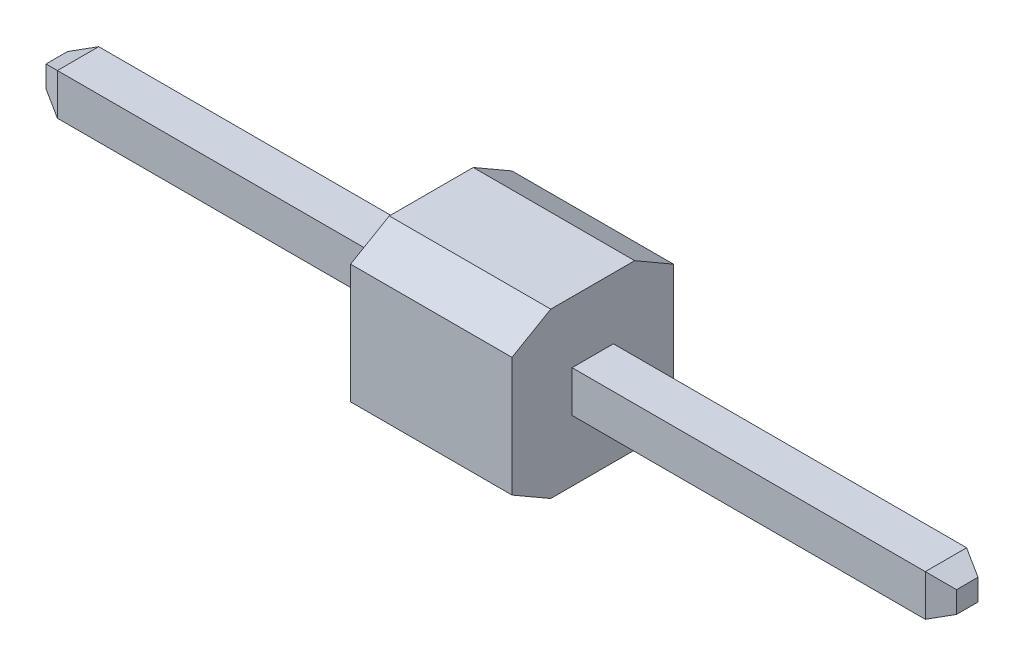
ISO-10303-21;
HEADER;
FILE_DESCRIPTION(('STEP AP214'),'2;1');
FILE_NAME('part.step','',(''),(''),'','','');
FILE_SCHEMA(('AUTOMOTIVE_DESIGN { 1 0 10303 214 1 1 1 1 }'));
ENDSEC;
DATA;
#1=APPLICATION_CONTEXT('core data for automotive mechanical design processes');
#2=APPLICATION_PROTOCOL_DEFINITION('international standard','automotive_design',2000,#1);
#3=PRODUCT_CONTEXT('',#1,'mechanical');
#4=PRODUCT('Part','Part','',(#3));
#5=PRODUCT_RELATED_PRODUCT_CATEGORY('part','',(#4));
#6=PRODUCT_DEFINITION_FORMATION('','',#4);
#7=PRODUCT_DEFINITION_CONTEXT('part definition',#1,'design');
#8=PRODUCT_DEFINITION('design','',#6,#7);
#9=PRODUCT_DEFINITION_SHAPE('','',#8);
#10=(LENGTH_UNIT() NAMED_UNIT(*) SI_UNIT(.MILLI.,.METRE.));
#11=(NAMED_UNIT(*) PLANE_ANGLE_UNIT() SI_UNIT($,.RADIAN.));
#12=(NAMED_UNIT(*) SI_UNIT($,.STERADIAN.) SOLID_ANGLE_UNIT());
#13=UNCERTAINTY_MEASURE_WITH_UNIT(LENGTH_MEASURE(1.E-05),#10,'distance_accuracy_value','');
#14=(GEOMETRIC_REPRESENTATION_CONTEXT(3) GLOBAL_UNCERTAINTY_ASSIGNED_CONTEXT((#13)) GLOBAL_UNIT_ASSIGNED_CONTEXT((#10,
#11,#12)) REPRESENTATION_CONTEXT('',''));
#15=CARTESIAN_POINT('',(0.,0.,0.));
#16=DIRECTION('',(0.,0.,1.));
#17=DIRECTION('',(1.,0.,0.));
#18=AXIS2_PLACEMENT_3D('',#15,#16,#17);
#19=CARTESIAN_POINT('',(5.42105035190831,-4.76287855189696,-2.62999781030106));
#20=DIRECTION('',(1.,-9.93476518829084E-08,4.37113882867379E-08));
#21=DIRECTION('',(-9.93476589883358E-08,-1.,8.74227765734759E-08));
#22=AXIS2_PLACEMENT_3D('',#19,#20,#21);
#23=PLANE('',#22);
#24=DIRECTION('',(-1.18186632778994E-08,-0.500000075710537,-0.866025360072935));
#25=VECTOR('',#24,1.);
#26=CARTESIAN_POINT('',(5.4210501597337,-6.00646825312919,-1.05999770158298));
#27=LINE('',#26,#25);
#28=CARTESIAN_POINT('',(5.4210501597337,-6.00646825312919,-1.05999770158298));
#29=VERTEX_POINT('',#28);
#30=CARTESIAN_POINT('',(5.42105015154549,-6.35287846709686,-1.65999767129884));
#31=VERTEX_POINT('',#30);
#32=EDGE_CURVE('E11',#29,#31,#27,.T.);
#33=ORIENTED_EDGE('',*,*,#32,.T.);
#34=DIRECTION('',(4.37113811813104E-08,-8.74227835422599E-08,-0.999999999999995));
#35=VECTOR('',#34,1.);
#36=CARTESIAN_POINT('',(5.42105015154549,-6.35287846709686,-1.65999767129884));
#37=LINE('',#36,#35);
#38=CARTESIAN_POINT('',(5.42105020837029,-6.35287858074648,-2.95999767129884));
#39=VERTEX_POINT('',#38);
#40=EDGE_CURVE('E304',#31,#39,#37,.T.);
#41=ORIENTED_EDGE('',*,*,#40,.T.);
#42=DIRECTION('',(8.75289963529268E-08,0.499999924289836,-0.866025447495713));
#43=VECTOR('',#42,1.);
#44=CARTESIAN_POINT('',(5.42105020837029,-6.35287858074648,-2.95999767129884));
#45=LINE('',#44,#43);
#46=CARTESIAN_POINT('',(5.42105026901216,-6.00646847168615,-3.55999770158298));
#47=VERTEX_POINT('',#46);
#48=EDGE_CURVE('E296',#39,#47,#45,.T.);
#49=ORIENTED_EDGE('',*,*,#48,.T.);
#50=DIRECTION('',(9.93476588435403E-08,0.999999999999991,-8.74227767225989E-08));
#51=VECTOR('',#50,1.);
#52=CARTESIAN_POINT('',(5.42105026901216,-6.00646847168615,-3.55999770158298));
#53=LINE('',#52,#51);
#54=CARTESIAN_POINT('',(5.42105045252513,-4.15928879471415,-3.55999786306856));
#55=VERTEX_POINT('',#54);
#56=EDGE_CURVE('E281',#47,#55,#53,.T.);
#57=ORIENTED_EDGE('',*,*,#56,.T.);
#58=DIRECTION('',(-1.18186632778994E-08,-0.500000075710538,-0.866025360072935));
#59=VECTOR('',#58,1.);
#60=CARTESIAN_POINT('',(5.42105046071334,-3.81287858074648,-2.95999789335269));
#61=LINE('',#60,#59);
#62=CARTESIAN_POINT('',(5.42105046071334,-3.81287858074648,-2.95999789335269));
#63=VERTEX_POINT('',#62);
#64=EDGE_CURVE('E265',#63,#55,#61,.T.);
#65=ORIENTED_EDGE('',*,*,#64,.F.);
#66=DIRECTION('',(4.37113811813104E-08,-8.74227828590458E-08,-0.999999999999995));
#67=VECTOR('',#66,1.);
#68=CARTESIAN_POINT('',(5.42105040388855,-3.81287846709686,-1.65999789335269));
#69=LINE('',#68,#67);
#70=CARTESIAN_POINT('',(5.42105040388855,-3.81287846709686,-1.65999789335269));
#71=VERTEX_POINT('',#70);
#72=EDGE_CURVE('E248',#71,#63,#69,.T.);
#73=ORIENTED_EDGE('',*,*,#72,.F.);
#74=DIRECTION('',(8.75289963529269E-08,0.499999924289835,-0.866025447495714));
#75=VECTOR('',#74,1.);
#76=CARTESIAN_POINT('',(5.42105034324668,-4.15928857615719,-1.05999786306856));
#77=LINE('',#76,#75);
#78=CARTESIAN_POINT('',(5.42105034324668,-4.15928857615719,-1.05999786306856));
#79=VERTEX_POINT('',#78);
#80=EDGE_CURVE('E242',#79,#71,#77,.T.);
#81=ORIENTED_EDGE('',*,*,#80,.F.);
#82=DIRECTION('',(9.93476588435403E-08,0.999999999999991,-8.74227763619768E-08));
#83=VECTOR('',#82,1.);
#84=CARTESIAN_POINT('',(5.4210501597337,-6.00646825312919,-1.05999770158298));
#85=LINE('',#84,#83);
#86=EDGE_CURVE('E236',#29,#79,#85,.T.);
#87=ORIENTED_EDGE('',*,*,#86,.F.);
#88=EDGE_LOOP('',(#33,#41,#49,#57,#65,#73,#81,#87));
#89=FACE_BOUND('',#88,.T.);
#90=DIRECTION('',(-4.37113817364219E-08,8.74227842895255E-08,0.999999999999995));
#91=VECTOR('',#90,1.);
#92=CARTESIAN_POINT('',(5.42105028832581,-5.40287855189696,-2.62999775435048));
#93=LINE('',#92,#91);
#94=CARTESIAN_POINT('',(5.42105028832581,-5.40287855189696,-2.62999775435048));
#95=VERTEX_POINT('',#94);
#96=CARTESIAN_POINT('',(5.42105026035053,-5.40287849594638,-1.98999775435048));
#97=VERTEX_POINT('',#96);
#98=EDGE_CURVE('E302',#95,#97,#93,.T.);
#99=ORIENTED_EDGE('',*,*,#98,.T.);
#100=DIRECTION('',(-9.93476592658907E-08,-0.999999999999991,8.74227763097972E-08));
#101=VECTOR('',#100,1.);
#102=CARTESIAN_POINT('',(5.42105032393303,-4.76287849594638,-1.98999781030106));
#103=LINE('',#102,#101);
#104=CARTESIAN_POINT('',(5.42105032393303,-4.76287849594638,-1.98999781030106));
#105=VERTEX_POINT('',#104);
#106=EDGE_CURVE('E293',#105,#97,#103,.T.);
#107=ORIENTED_EDGE('',*,*,#106,.F.);
#108=DIRECTION('',(-4.37113803486431E-08,8.74227842895254E-08,0.999999999999995));
#109=VECTOR('',#108,1.);
#110=CARTESIAN_POINT('',(5.42105035190831,-4.76287855189696,-2.62999781030106));
#111=LINE('',#110,#109);
#112=CARTESIAN_POINT('',(5.42105035190831,-4.76287855189696,-2.62999781030106));
#113=VERTEX_POINT('',#112);
#114=EDGE_CURVE('E278',#113,#105,#111,.T.);
#115=ORIENTED_EDGE('',*,*,#114,.F.);
#116=DIRECTION('',(-9.93476578781119E-08,-0.999999999999991,8.74227766567419E-08));
#117=VECTOR('',#116,1.);
#118=CARTESIAN_POINT('',(5.42105035190831,-4.76287855189696,-2.62999781030106));
#119=LINE('',#118,#117);
#120=EDGE_CURVE('E263',#113,#95,#119,.T.);
#121=ORIENTED_EDGE('',*,*,#120,.T.);
#122=EDGE_LOOP('',(#99,#107,#115,#121));
#123=FACE_BOUND('',#122,.T.);
#124=ADVANCED_FACE('F17',(#89,#123),#23,.T.);
#125=CARTESIAN_POINT('',(2.92105035190831,-4.76287830352783,-2.62999791957953));
#126=DIRECTION('',(1.,-9.93476518829084E-08,4.37113882867379E-08));
#127=DIRECTION('',(-9.93476589883358E-08,-1.,8.74227765734759E-08));
#128=AXIS2_PLACEMENT_3D('',#125,#126,#127);
#129=PLANE('',#128);
#130=DIRECTION('',(-1.18186626369119E-08,-0.500000075710537,-0.866025360072935));
#131=VECTOR('',#130,1.);
#132=CARTESIAN_POINT('',(2.9210501597337,-6.00646800476006,-1.05999781086145));
#133=LINE('',#132,#131);
#134=CARTESIAN_POINT('',(2.9210501597337,-6.00646800476006,-1.05999781086145));
#135=VERTEX_POINT('',#134);
#136=CARTESIAN_POINT('',(2.92105015154549,-6.35287821872773,-1.65999778057731));
#137=VERTEX_POINT('',#136);
#138=EDGE_CURVE('E24',#135,#137,#133,.T.);
#139=ORIENTED_EDGE('',*,*,#138,.F.);
#140=DIRECTION('',(9.9347659083955E-08,0.999999999999991,-8.74227763619768E-08));
#141=VECTOR('',#140,1.);
#142=CARTESIAN_POINT('',(2.9210501597337,-6.00646800476006,-1.05999781086145));
#143=LINE('',#142,#141);
#144=CARTESIAN_POINT('',(2.92105034324668,-4.15928832778806,-1.05999797234703));
#145=VERTEX_POINT('',#144);
#146=EDGE_CURVE('E300',#135,#145,#143,.T.);
#147=ORIENTED_EDGE('',*,*,#146,.T.);
#148=DIRECTION('',(8.75289957119393E-08,0.499999924289835,-0.866025447495714));
#149=VECTOR('',#148,1.);
#150=CARTESIAN_POINT('',(2.92105034324668,-4.15928832778806,-1.05999797234703));
#151=LINE('',#150,#149);
#152=CARTESIAN_POINT('',(2.92105040388855,-3.81287821872773,-1.65999800263116));
#153=VERTEX_POINT('',#152);
#154=EDGE_CURVE('E286',#145,#153,#151,.T.);
#155=ORIENTED_EDGE('',*,*,#154,.T.);
#156=DIRECTION('',(4.37113811813104E-08,-8.74227828590458E-08,-0.999999999999995));
#157=VECTOR('',#156,1.);
#158=CARTESIAN_POINT('',(2.92105040388855,-3.81287821872773,-1.65999800263116));
#159=LINE('',#158,#157);
#160=CARTESIAN_POINT('',(2.92105046071334,-3.81287833237735,-2.95999800263116));
#161=VERTEX_POINT('',#160);
#162=EDGE_CURVE('E271',#153,#161,#159,.T.);
#163=ORIENTED_EDGE('',*,*,#162,.T.);
#164=DIRECTION('',(-1.18186626369119E-08,-0.500000075710538,-0.866025360072935));
#165=VECTOR('',#164,1.);
#166=CARTESIAN_POINT('',(2.92105046071334,-3.81287833237735,-2.95999800263116));
#167=LINE('',#166,#165);
#168=CARTESIAN_POINT('',(2.92105045252513,-4.15928854634502,-3.55999797234703));
#169=VERTEX_POINT('',#168);
#170=EDGE_CURVE('E253',#161,#169,#167,.T.);
#171=ORIENTED_EDGE('',*,*,#170,.T.);
#172=DIRECTION('',(9.9347659083955E-08,0.999999999999991,-8.74227767225989E-08));
#173=VECTOR('',#172,1.);
#174=CARTESIAN_POINT('',(2.92105026901216,-6.00646822331702,-3.55999781086145));
#175=LINE('',#174,#173);
#176=CARTESIAN_POINT('',(2.92105026901216,-6.00646822331702,-3.55999781086145));
#177=VERTEX_POINT('',#176);
#178=EDGE_CURVE('E261',#177,#169,#175,.T.);
#179=ORIENTED_EDGE('',*,*,#178,.F.);
#180=DIRECTION('',(8.75289957119392E-08,0.499999924289836,-0.866025447495713));
#181=VECTOR('',#180,1.);
#182=CARTESIAN_POINT('',(2.92105020837029,-6.35287833237735,-2.95999778057731));
#183=LINE('',#182,#181);
#184=CARTESIAN_POINT('',(2.92105020837029,-6.35287833237735,-2.95999778057731));
#185=VERTEX_POINT('',#184);
#186=EDGE_CURVE('E276',#185,#177,#183,.T.);
#187=ORIENTED_EDGE('',*,*,#186,.F.);
#188=DIRECTION('',(4.37113811813104E-08,-8.74227835422599E-08,-0.999999999999995));
#189=VECTOR('',#188,1.);
#190=CARTESIAN_POINT('',(2.92105015154549,-6.35287821872773,-1.65999778057731));
#191=LINE('',#190,#189);
#192=EDGE_CURVE('E291',#137,#185,#191,.T.);
#193=ORIENTED_EDGE('',*,*,#192,.F.);
#194=EDGE_LOOP('',(#139,#147,#155,#163,#171,#179,#187,#193));
#195=FACE_BOUND('',#194,.T.);
#196=DIRECTION('',(-9.93476592658907E-08,-0.999999999999991,8.74227763097972E-08));
#197=VECTOR('',#196,1.);
#198=CARTESIAN_POINT('',(2.92105032393303,-4.76287824757725,-1.98999791957953));
#199=LINE('',#198,#197);
#200=CARTESIAN_POINT('',(2.92105032393303,-4.76287824757725,-1.98999791957953));
#201=VERTEX_POINT('',#200);
#202=CARTESIAN_POINT('',(2.92105026035053,-5.40287824757725,-1.98999786362895));
#203=VERTEX_POINT('',#202);
#204=EDGE_CURVE('E298',#201,#203,#199,.T.);
#205=ORIENTED_EDGE('',*,*,#204,.T.);
#206=DIRECTION('',(-4.37113810425325E-08,8.74227842895255E-08,0.999999999999995));
#207=VECTOR('',#206,1.);
#208=CARTESIAN_POINT('',(2.92105028832581,-5.40287830352783,-2.62999786362895));
#209=LINE('',#208,#207);
#210=CARTESIAN_POINT('',(2.92105028832581,-5.40287830352783,-2.62999786362895));
#211=VERTEX_POINT('',#210);
#212=EDGE_CURVE('E283',#211,#203,#209,.T.);
#213=ORIENTED_EDGE('',*,*,#212,.F.);
#214=DIRECTION('',(-9.93476592658907E-08,-0.999999999999991,8.74227766567419E-08));
#215=VECTOR('',#214,1.);
#216=CARTESIAN_POINT('',(2.92105035190831,-4.76287830352783,-2.62999791957953));
#217=LINE('',#216,#215);
#218=CARTESIAN_POINT('',(2.92105035190831,-4.76287830352783,-2.62999791957953));
#219=VERTEX_POINT('',#218);
#220=EDGE_CURVE('E268',#219,#211,#217,.T.);
#221=ORIENTED_EDGE('',*,*,#220,.F.);
#222=DIRECTION('',(-4.37113810425325E-08,8.74227842895254E-08,0.999999999999995));
#223=VECTOR('',#222,1.);
#224=CARTESIAN_POINT('',(2.92105035190831,-4.76287830352783,-2.62999791957953));
#225=LINE('',#224,#223);
#226=EDGE_CURVE('E251',#219,#201,#225,.T.);
#227=ORIENTED_EDGE('',*,*,#226,.T.);
#228=EDGE_LOOP('',(#205,#213,#221,#227));
#229=FACE_BOUND('',#228,.T.);
#230=ADVANCED_FACE('F314',(#195,#229),#129,.F.);
#231=CARTESIAN_POINT('',(5.4210501597337,-6.00646825312919,-1.05999770158298));
#232=DIRECTION('',(1.07893287081065E-07,0.866025360072937,-0.500000075710535));
#233=DIRECTION('',(1.18186629566715E-08,0.500000075710542,0.866025360072941));
#234=AXIS2_PLACEMENT_3D('',#231,#232,#233);
#235=PLANE('',#234);
#236=ORIENTED_EDGE('',*,*,#138,.T.);
#237=DIRECTION('',(-0.999999999999994,9.93476522381792E-08,-4.37113884643734E-08));
#238=VECTOR('',#237,1.);
#239=CARTESIAN_POINT('',(5.42105015154549,-6.35287846709686,-1.65999767129884));
#240=LINE('',#239,#238);
#241=EDGE_CURVE('E288',#31,#137,#240,.T.);
#242=ORIENTED_EDGE('',*,*,#241,.F.);
#243=ORIENTED_EDGE('',*,*,#32,.F.);
#244=DIRECTION('',(-0.999999999999994,9.93476525934505E-08,-4.3711388109102E-08));
#245=VECTOR('',#244,1.);
#246=CARTESIAN_POINT('',(5.4210501597337,-6.00646825312919,-1.05999770158298));
#247=LINE('',#246,#245);
#248=EDGE_CURVE('E256',#29,#135,#247,.T.);
#249=ORIENTED_EDGE('',*,*,#248,.T.);
#250=EDGE_LOOP('',(#236,#242,#243,#249));
#251=FACE_BOUND('',#250,.T.);
#252=ADVANCED_FACE('F306',(#251),#235,.F.);
#253=CARTESIAN_POINT('',(5.42105015154549,-6.35287846709686,-1.65999767129884));
#254=DIRECTION('',(9.93476589883358E-08,1.,-8.74227765734759E-08));
#255=DIRECTION('',(1.,-9.93476518829084E-08,4.37113882867379E-08));
#256=AXIS2_PLACEMENT_3D('',#253,#254,#255);
#257=PLANE('',#256);
#258=ORIENTED_EDGE('',*,*,#192,.T.);
#259=DIRECTION('',(-0.999999999999994,9.93476522381792E-08,-4.37113882867377E-08));
#260=VECTOR('',#259,1.);
#261=CARTESIAN_POINT('',(5.42105020837029,-6.35287858074648,-2.95999767129884));
#262=LINE('',#261,#260);
#263=EDGE_CURVE('E273',#39,#185,#262,.T.);
#264=ORIENTED_EDGE('',*,*,#263,.F.);
#265=ORIENTED_EDGE('',*,*,#40,.F.);
#266=ORIENTED_EDGE('',*,*,#241,.T.);
#267=EDGE_LOOP('',(#258,#264,#265,#266));
#268=FACE_BOUND('',#267,.T.);
#269=ADVANCED_FACE('F311',(#268),#257,.F.);
#270=CARTESIAN_POINT('',(5.42105020837029,-6.35287858074648,-2.95999767129884));
#271=DIRECTION('',(6.41819058997377E-08,0.866025447495721,0.499999924289845));
#272=DIRECTION('',(-8.7528996031702E-08,-0.499999924289838,0.866025447495717));
#273=AXIS2_PLACEMENT_3D('',#270,#271,#272);
#274=PLANE('',#273);
#275=ORIENTED_EDGE('',*,*,#186,.T.);
#276=DIRECTION('',(-0.999999999999994,9.93476525934505E-08,-4.37113884643734E-08));
#277=VECTOR('',#276,1.);
#278=CARTESIAN_POINT('',(5.42105026901216,-6.00646847168615,-3.55999770158298));
#279=LINE('',#278,#277);
#280=EDGE_CURVE('E258',#47,#177,#279,.T.);
#281=ORIENTED_EDGE('',*,*,#280,.F.);
#282=ORIENTED_EDGE('',*,*,#48,.F.);
#283=ORIENTED_EDGE('',*,*,#263,.T.);
#284=EDGE_LOOP('',(#275,#281,#282,#283));
#285=FACE_BOUND('',#284,.T.);
#286=ADVANCED_FACE('F319',(#285),#274,.F.);
#287=CARTESIAN_POINT('',(5.42105026901216,-6.00646847168615,-3.55999770158298));
#288=DIRECTION('',(-4.37113811813106E-08,8.74227836789032E-08,1.));
#289=DIRECTION('',(-1.,9.93476518829084E-08,-4.37113882867379E-08));
#290=AXIS2_PLACEMENT_3D('',#287,#288,#289);
#291=PLANE('',#290);
#292=ORIENTED_EDGE('',*,*,#178,.T.);
#293=DIRECTION('',(-0.999999999999994,9.93476518829078E-08,-4.37113882867377E-08));
#294=VECTOR('',#293,1.);
#295=CARTESIAN_POINT('',(5.42105045252513,-4.15928879471415,-3.55999786306856));
#296=LINE('',#295,#294);
#297=EDGE_CURVE('E245',#55,#169,#296,.T.);
#298=ORIENTED_EDGE('',*,*,#297,.F.);
#299=ORIENTED_EDGE('',*,*,#56,.F.);
#300=ORIENTED_EDGE('',*,*,#280,.T.);
#301=EDGE_LOOP('',(#292,#298,#299,#300));
#302=FACE_BOUND('',#301,.T.);
#303=ADVANCED_FACE('F326',(#302),#291,.F.);
#304=CARTESIAN_POINT('',(5.42105046071334,-3.81287858074648,-2.95999789335269));
#305=DIRECTION('',(1.07893287081065E-07,0.866025360072937,-0.500000075710535));
#306=DIRECTION('',(1.18186629566715E-08,0.500000075710542,0.866025360072941));
#307=AXIS2_PLACEMENT_3D('',#304,#305,#306);
#308=PLANE('',#307);
#309=ORIENTED_EDGE('',*,*,#170,.F.);
#310=DIRECTION('',(-0.999999999999994,9.93476518829078E-08,-4.37113884643734E-08));
#311=VECTOR('',#310,1.);
#312=CARTESIAN_POINT('',(5.42105046071334,-3.81287858074648,-2.95999789335269));
#313=LINE('',#312,#311);
#314=EDGE_CURVE('E239',#63,#161,#313,.T.);
#315=ORIENTED_EDGE('',*,*,#314,.F.);
#316=ORIENTED_EDGE('',*,*,#64,.T.);
#317=ORIENTED_EDGE('',*,*,#297,.T.);
#318=EDGE_LOOP('',(#309,#315,#316,#317));
#319=FACE_BOUND('',#318,.T.);
#320=ADVANCED_FACE('F329',(#319),#308,.T.);
#321=CARTESIAN_POINT('',(5.42105040388855,-3.81287846709686,-1.65999789335269));
#322=DIRECTION('',(9.93476589883358E-08,1.,-8.74227765734759E-08));
#323=DIRECTION('',(1.,-9.93476518829084E-08,4.37113882867379E-08));
#324=AXIS2_PLACEMENT_3D('',#321,#322,#323);
#325=PLANE('',#324);
#326=ORIENTED_EDGE('',*,*,#162,.F.);
#327=DIRECTION('',(-0.999999999999994,9.93476518829078E-08,-4.37113883755555E-08));
#328=VECTOR('',#327,1.);
#329=CARTESIAN_POINT('',(5.42105040388855,-3.81287846709686,-1.65999789335269));
#330=LINE('',#329,#328);
#331=EDGE_CURVE('E233',#71,#153,#330,.T.);
#332=ORIENTED_EDGE('',*,*,#331,.F.);
#333=ORIENTED_EDGE('',*,*,#72,.T.);
#334=ORIENTED_EDGE('',*,*,#314,.T.);
#335=EDGE_LOOP('',(#326,#332,#333,#334));
#336=FACE_BOUND('',#335,.T.);
#337=ADVANCED_FACE('F333',(#336),#325,.T.);
#338=CARTESIAN_POINT('',(5.42105034324668,-4.15928857615719,-1.05999786306856));
#339=DIRECTION('',(6.41819058997377E-08,0.866025447495721,0.499999924289845));
#340=DIRECTION('',(-8.7528996031702E-08,-0.499999924289838,0.866025447495717));
#341=AXIS2_PLACEMENT_3D('',#338,#339,#340);
#342=PLANE('',#341);
#343=ORIENTED_EDGE('',*,*,#154,.F.);
#344=DIRECTION('',(-0.999999999999994,9.93476518829078E-08,-4.3711388109102E-08));
#345=VECTOR('',#344,1.);
#346=CARTESIAN_POINT('',(5.42105034324668,-4.15928857615719,-1.05999786306856));
#347=LINE('',#346,#345);
#348=EDGE_CURVE('E230',#79,#145,#347,.T.);
#349=ORIENTED_EDGE('',*,*,#348,.F.);
#350=ORIENTED_EDGE('',*,*,#80,.T.);
#351=ORIENTED_EDGE('',*,*,#331,.T.);
#352=EDGE_LOOP('',(#343,#349,#350,#351));
#353=FACE_BOUND('',#352,.T.);
#354=ADVANCED_FACE('F337',(#353),#342,.T.);
#355=CARTESIAN_POINT('',(5.4210501597337,-6.00646825312919,-1.05999770158298));
#356=DIRECTION('',(-4.37113811813106E-08,8.74227835615132E-08,1.));
#357=DIRECTION('',(-9.93476589883358E-08,-1.,8.74227764560859E-08));
#358=AXIS2_PLACEMENT_3D('',#355,#356,#357);
#359=PLANE('',#358);
#360=ORIENTED_EDGE('',*,*,#146,.F.);
#361=ORIENTED_EDGE('',*,*,#248,.F.);
#362=ORIENTED_EDGE('',*,*,#86,.T.);
#363=ORIENTED_EDGE('',*,*,#348,.T.);
#364=EDGE_LOOP('',(#360,#361,#362,#363));
#365=FACE_BOUND('',#364,.T.);
#366=ADVANCED_FACE('F339',(#365),#359,.T.);
#367=CARTESIAN_POINT('',(-2.87894964809169,-4.76287772731145,-2.62999817310558));
#368=DIRECTION('',(-1.,9.93476518829084E-08,-4.37113882867379E-08));
#369=DIRECTION('',(9.93476589883358E-08,1.,-8.74227765734759E-08));
#370=AXIS2_PLACEMENT_3D('',#367,#368,#369);
#371=PLANE('',#370);
#372=DIRECTION('',(9.93476661653848E-08,0.999999999999991,-8.74227774760713E-08));
#373=VECTOR('',#372,1.);
#374=CARTESIAN_POINT('',(-2.87894971763533,-5.24899615762262,-2.14387965779875));
#375=LINE('',#374,#373);
#376=CARTESIAN_POINT('',(-2.87894971763533,-5.24899615762262,-2.14387965779875));
#377=VERTEX_POINT('',#376);
#378=CARTESIAN_POINT('',(-2.87894968462837,-4.91675921200462,-2.14387968684383));
#379=VERTEX_POINT('',#378);
#380=EDGE_CURVE('E228',#377,#379,#375,.T.);
#381=ORIENTED_EDGE('',*,*,#380,.T.);
#382=DIRECTION('',(4.37113793813867E-08,-8.74227828227278E-08,-0.999999999999995));
#383=VECTOR('',#382,1.);
#384=CARTESIAN_POINT('',(-2.87894968462837,-4.91675921200462,-2.14387968684383));
#385=LINE('',#384,#383);
#386=CARTESIAN_POINT('',(-2.87894967010583,-4.9167592410497,-2.47611663246183));
#387=VERTEX_POINT('',#386);
#388=EDGE_CURVE('E223',#379,#387,#385,.T.);
#389=ORIENTED_EDGE('',*,*,#388,.T.);
#390=DIRECTION('',(-9.9347660818728E-08,-0.999999999999991,8.74227774760711E-08));
#391=VECTOR('',#390,1.);
#392=CARTESIAN_POINT('',(-2.87894967010583,-4.9167592410497,-2.47611663246183));
#393=LINE('',#392,#391);
#394=CARTESIAN_POINT('',(-2.87894970311279,-5.2489961866677,-2.47611660341675));
#395=VERTEX_POINT('',#394);
#396=EDGE_CURVE('E215',#387,#395,#393,.T.);
#397=ORIENTED_EDGE('',*,*,#396,.T.);
#398=DIRECTION('',(-4.37113767080584E-08,8.74227801493995E-08,0.999999999999995));
#399=VECTOR('',#398,1.);
#400=CARTESIAN_POINT('',(-2.87894970311279,-5.2489961866677,-2.47611660341675));
#401=LINE('',#400,#399);
#402=EDGE_CURVE('E207',#395,#377,#401,.T.);
#403=ORIENTED_EDGE('',*,*,#402,.T.);
#404=EDGE_LOOP('',(#381,#389,#397,#403));
#405=FACE_BOUND('',#404,.T.);
#406=ADVANCED_FACE('F341',(#405),#371,.T.);
#407=CARTESIAN_POINT('',(-2.87894964809169,-4.76287772731145,-2.62999817310558));
#408=DIRECTION('',(9.93476589883358E-08,1.,-8.74227764510112E-08));
#409=DIRECTION('',(-4.37113811813106E-08,8.74227835564385E-08,1.));
#410=AXIS2_PLACEMENT_3D('',#407,#408,#409);
#411=PLANE('',#410);
#412=DIRECTION('',(0.999999999999994,-9.93476524284799E-08,4.37113882769953E-08));
#413=VECTOR('',#412,1.);
#414=CARTESIAN_POINT('',(-2.54894964809169,-4.76287776009618,-2.62999815868082));
#415=LINE('',#414,#413);
#416=CARTESIAN_POINT('',(-2.54894964809169,-4.76287776009618,-2.62999815868082));
#417=VERTEX_POINT('',#416);
#418=EDGE_CURVE('E225',#417,#219,#415,.T.);
#419=ORIENTED_EDGE('',*,*,#418,.F.);
#420=DIRECTION('',(-4.37113803486431E-08,8.74227842895254E-08,0.999999999999995));
#421=VECTOR('',#420,1.);
#422=CARTESIAN_POINT('',(-2.54894964809169,-4.76287776009618,-2.62999815868082));
#423=LINE('',#422,#421);
#424=CARTESIAN_POINT('',(-2.54894967606697,-4.76287770414559,-1.98999815868082));
#425=VERTEX_POINT('',#424);
#426=EDGE_CURVE('E217',#417,#425,#423,.T.);
#427=ORIENTED_EDGE('',*,*,#426,.T.);
#428=DIRECTION('',(0.999999999999994,-9.93476524284799E-08,4.3711388195809E-08));
#429=VECTOR('',#428,1.);
#430=CARTESIAN_POINT('',(-2.54894967606697,-4.76287770414559,-1.98999815868082));
#431=LINE('',#430,#429);
#432=EDGE_CURVE('E220',#425,#201,#431,.T.);
#433=ORIENTED_EDGE('',*,*,#432,.T.);
#434=ORIENTED_EDGE('',*,*,#226,.F.);
#435=EDGE_LOOP('',(#419,#427,#433,#434));
#436=FACE_BOUND('',#435,.T.);
#437=ADVANCED_FACE('F348',(#436),#411,.T.);
#438=CARTESIAN_POINT('',(-2.87894967606697,-4.76287767136087,-1.98999817310558));
#439=DIRECTION('',(-4.37113811813106E-08,8.74227836789032E-08,1.));
#440=DIRECTION('',(-1.,9.93476518829084E-08,-4.37113882867379E-08));
#441=AXIS2_PLACEMENT_3D('',#438,#439,#440);
#442=PLANE('',#441);
#443=ORIENTED_EDGE('',*,*,#432,.F.);
#444=DIRECTION('',(-9.93476592658907E-08,-0.999999999999991,8.74227763097972E-08));
#445=VECTOR('',#444,1.);
#446=CARTESIAN_POINT('',(-2.54894967606697,-4.76287770414559,-1.98999815868082));
#447=LINE('',#446,#445);
#448=CARTESIAN_POINT('',(-2.54894973964947,-5.40287770414559,-1.98999810273024));
#449=VERTEX_POINT('',#448);
#450=EDGE_CURVE('E209',#425,#449,#447,.T.);
#451=ORIENTED_EDGE('',*,*,#450,.T.);
#452=DIRECTION('',(0.999999999999994,-9.93476512918714E-08,4.37113882364022E-08));
#453=VECTOR('',#452,1.);
#454=CARTESIAN_POINT('',(-2.54894973964947,-5.40287770414559,-1.98999810273024));
#455=LINE('',#454,#453);
#456=EDGE_CURVE('E212',#449,#203,#455,.T.);
#457=ORIENTED_EDGE('',*,*,#456,.T.);
#458=ORIENTED_EDGE('',*,*,#204,.F.);
#459=EDGE_LOOP('',(#443,#451,#457,#458));
#460=FACE_BOUND('',#459,.T.);
#461=ADVANCED_FACE('F424',(#460),#442,.T.);
#462=CARTESIAN_POINT('',(-2.87894971167419,-5.40287772731145,-2.629998117155));
#463=DIRECTION('',(9.93476589883357E-08,1.,-8.74227764040693E-08));
#464=DIRECTION('',(-4.37113811813106E-08,8.74227835094966E-08,1.));
#465=AXIS2_PLACEMENT_3D('',#462,#463,#464);
#466=PLANE('',#465);
#467=ORIENTED_EDGE('',*,*,#456,.F.);
#468=DIRECTION('',(4.37113831242007E-08,-8.7422787065083E-08,-0.999999999999995));
#469=VECTOR('',#468,1.);
#470=CARTESIAN_POINT('',(-2.54894973964947,-5.40287770414559,-1.98999810273024));
#471=LINE('',#470,#469);
#472=CARTESIAN_POINT('',(-2.54894971167419,-5.40287776009618,-2.62999810273024));
#473=VERTEX_POINT('',#472);
#474=EDGE_CURVE('E201',#449,#473,#471,.T.);
#475=ORIENTED_EDGE('',*,*,#474,.T.);
#476=DIRECTION('',(0.999999999999994,-9.93476512918714E-08,4.37113882769953E-08));
#477=VECTOR('',#476,1.);
#478=CARTESIAN_POINT('',(-2.54894971167419,-5.40287776009618,-2.62999810273024));
#479=LINE('',#478,#477);
#480=EDGE_CURVE('E204',#473,#211,#479,.T.);
#481=ORIENTED_EDGE('',*,*,#480,.T.);
#482=ORIENTED_EDGE('',*,*,#212,.T.);
#483=EDGE_LOOP('',(#467,#475,#481,#482));
#484=FACE_BOUND('',#483,.T.);
#485=ADVANCED_FACE('F421',(#484),#466,.F.);
#486=CARTESIAN_POINT('',(-2.87894964809169,-4.76287772731145,-2.62999817310558));
#487=DIRECTION('',(-4.37113811813106E-08,8.74227836789032E-08,1.));
#488=DIRECTION('',(-1.,9.93476518829084E-08,-4.37113882867379E-08));
#489=AXIS2_PLACEMENT_3D('',#486,#487,#488);
#490=PLANE('',#489);
#491=ORIENTED_EDGE('',*,*,#480,.F.);
#492=DIRECTION('',(9.9347659265891E-08,0.999999999999991,-8.74227766567421E-08));
#493=VECTOR('',#492,1.);
#494=CARTESIAN_POINT('',(-2.54894971167419,-5.40287776009617,-2.62999810273024));
#495=LINE('',#494,#493);
#496=EDGE_CURVE('E196',#473,#417,#495,.T.);
#497=ORIENTED_EDGE('',*,*,#496,.T.);
#498=ORIENTED_EDGE('',*,*,#418,.T.);
#499=ORIENTED_EDGE('',*,*,#220,.T.);
#500=EDGE_LOOP('',(#491,#497,#498,#499));
#501=FACE_BOUND('',#500,.T.);
#502=ADVANCED_FACE('F376',(#501),#490,.F.);
#503=CARTESIAN_POINT('',(-2.87894964809169,-4.76287772731145,-2.62999817310558));
#504=DIRECTION('',(-4.37113811813106E-08,8.74227836789032E-08,1.));
#505=DIRECTION('',(-1.,9.93476518829084E-08,-4.37113882867379E-08));
#506=AXIS2_PLACEMENT_3D('',#503,#504,#505);
#507=PLANE('',#506);
#508=DIRECTION('',(0.999999999999994,-9.93476545393245E-08,4.37113882769953E-08));
#509=VECTOR('',#508,1.);
#510=CARTESIAN_POINT('',(5.42105035190831,-4.76287855189696,-2.62999781030106));
#511=LINE('',#510,#509);
#512=CARTESIAN_POINT('',(10.8910503519083,-4.76287909532862,-2.62999757119976));
#513=VERTEX_POINT('',#512);
#514=EDGE_CURVE('E199',#113,#513,#511,.T.);
#515=ORIENTED_EDGE('',*,*,#514,.T.);
#516=DIRECTION('',(-9.93476606536695E-08,-0.999999999999991,8.74227766567419E-08));
#517=VECTOR('',#516,1.);
#518=CARTESIAN_POINT('',(10.8910503519083,-4.76287909532862,-2.62999757119976));
#519=LINE('',#518,#517);
#520=CARTESIAN_POINT('',(10.8910502883258,-5.40287909532862,-2.62999751524918));
#521=VERTEX_POINT('',#520);
#522=EDGE_CURVE('E191',#513,#521,#519,.T.);
#523=ORIENTED_EDGE('',*,*,#522,.T.);
#524=DIRECTION('',(0.999999999999994,-9.93476545393245E-08,4.37113882769953E-08));
#525=VECTOR('',#524,1.);
#526=CARTESIAN_POINT('',(5.42105028832581,-5.40287855189696,-2.62999775435048));
#527=LINE('',#526,#525);
#528=EDGE_CURVE('E194',#95,#521,#527,.T.);
#529=ORIENTED_EDGE('',*,*,#528,.F.);
#530=ORIENTED_EDGE('',*,*,#120,.F.);
#531=EDGE_LOOP('',(#515,#523,#529,#530));
#532=FACE_BOUND('',#531,.T.);
#533=ADVANCED_FACE('F367',(#532),#507,.F.);
#534=CARTESIAN_POINT('',(-2.87894971167419,-5.40287772731145,-2.629998117155));
#535=DIRECTION('',(9.93476589883357E-08,1.,-8.74227764040693E-08));
#536=DIRECTION('',(-4.37113811813106E-08,8.74227835094966E-08,1.));
#537=AXIS2_PLACEMENT_3D('',#534,#535,#536);
#538=PLANE('',#537);
#539=ORIENTED_EDGE('',*,*,#528,.T.);
#540=DIRECTION('',(-4.37113845119794E-08,8.74227842895255E-08,0.999999999999995));
#541=VECTOR('',#540,1.);
#542=CARTESIAN_POINT('',(10.8910502883258,-5.40287909532862,-2.62999751524918));
#543=LINE('',#542,#541);
#544=CARTESIAN_POINT('',(10.8910502603505,-5.40287903937804,-1.98999751524918));
#545=VERTEX_POINT('',#544);
#546=EDGE_CURVE('E186',#521,#545,#543,.T.);
#547=ORIENTED_EDGE('',*,*,#546,.T.);
#548=DIRECTION('',(0.999999999999994,-9.93476545393245E-08,4.37113881146227E-08));
#549=VECTOR('',#548,1.);
#550=CARTESIAN_POINT('',(5.42105026035053,-5.40287849594638,-1.98999775435048));
#551=LINE('',#550,#549);
#552=EDGE_CURVE('E189',#97,#545,#551,.T.);
#553=ORIENTED_EDGE('',*,*,#552,.F.);
#554=ORIENTED_EDGE('',*,*,#98,.F.);
#555=EDGE_LOOP('',(#539,#547,#553,#554));
#556=FACE_BOUND('',#555,.T.);
#557=ADVANCED_FACE('F364',(#556),#538,.F.);
#558=CARTESIAN_POINT('',(-2.87894967606697,-4.76287767136087,-1.98999817310558));
#559=DIRECTION('',(-4.37113811813106E-08,8.74227836789032E-08,1.));
#560=DIRECTION('',(-1.,9.93476518829084E-08,-4.37113882867379E-08));
#561=AXIS2_PLACEMENT_3D('',#558,#559,#560);
#562=PLANE('',#561);
#563=ORIENTED_EDGE('',*,*,#552,.T.);
#564=DIRECTION('',(9.93476578781122E-08,0.999999999999991,-8.74227759628527E-08));
#565=VECTOR('',#564,1.);
#566=CARTESIAN_POINT('',(10.8910502603505,-5.40287903937803,-1.98999751524918));
#567=LINE('',#566,#565);
#568=CARTESIAN_POINT('',(10.891050323933,-4.76287903937804,-1.98999757119976));
#569=VERTEX_POINT('',#568);
#570=EDGE_CURVE('E176',#545,#569,#567,.T.);
#571=ORIENTED_EDGE('',*,*,#570,.T.);
#572=DIRECTION('',(0.999999999999994,-9.93476545393245E-08,4.37113881146227E-08));
#573=VECTOR('',#572,1.);
#574=CARTESIAN_POINT('',(5.42105032393303,-4.76287849594638,-1.98999781030106));
#575=LINE('',#574,#573);
#576=EDGE_CURVE('E179',#105,#569,#575,.T.);
#577=ORIENTED_EDGE('',*,*,#576,.F.);
#578=ORIENTED_EDGE('',*,*,#106,.T.);
#579=EDGE_LOOP('',(#563,#571,#577,#578));
#580=FACE_BOUND('',#579,.T.);
#581=ADVANCED_FACE('F366',(#580),#562,.T.);
#582=CARTESIAN_POINT('',(-2.87894964809169,-4.76287772731145,-2.62999817310558));
#583=DIRECTION('',(9.93476589883358E-08,1.,-8.74227764510112E-08));
#584=DIRECTION('',(-4.37113811813106E-08,8.74227835564385E-08,1.));
#585=AXIS2_PLACEMENT_3D('',#582,#583,#584);
#586=PLANE('',#585);
#587=ORIENTED_EDGE('',*,*,#576,.T.);
#588=DIRECTION('',(4.37113789608643E-08,-8.74227842895254E-08,-0.999999999999995));
#589=VECTOR('',#588,1.);
#590=CARTESIAN_POINT('',(10.891050323933,-4.76287903937804,-1.98999757119976));
#591=LINE('',#590,#589);
#592=EDGE_CURVE('E167',#569,#513,#591,.T.);
#593=ORIENTED_EDGE('',*,*,#592,.T.);
#594=ORIENTED_EDGE('',*,*,#514,.F.);
#595=ORIENTED_EDGE('',*,*,#114,.T.);
#596=EDGE_LOOP('',(#587,#593,#594,#595));
#597=FACE_BOUND('',#596,.T.);
#598=ADVANCED_FACE('F373',(#597),#586,.T.);
#599=CARTESIAN_POINT('',(11.2210503519083,-4.76287912811334,-2.629997556775));
#600=DIRECTION('',(-1.,9.93476518829084E-08,-4.37113882867379E-08));
#601=DIRECTION('',(9.93476589883358E-08,1.,-8.74227765734759E-08));
#602=AXIS2_PLACEMENT_3D('',#599,#600,#601);
#603=PLANE('',#602);
#604=DIRECTION('',(-9.93476581453997E-08,-0.999999999999991,8.7422776139407E-08));
#605=VECTOR('',#604,1.);
#606=CARTESIAN_POINT('',(11.2210503153716,-4.91676061280651,-2.14387907051325));
#607=LINE('',#606,#605);
#608=CARTESIAN_POINT('',(11.2210503153716,-4.91676061280651,-2.14387907051325));
#609=VERTEX_POINT('',#608);
#610=CARTESIAN_POINT('',(11.2210502823647,-5.24899755842451,-2.14387904146818));
#611=VERTEX_POINT('',#610);
#612=EDGE_CURVE('E153',#609,#611,#607,.T.);
#613=ORIENTED_EDGE('',*,*,#612,.T.);
#614=DIRECTION('',(4.37113820547149E-08,-8.74227828227278E-08,-0.999999999999995));
#615=VECTOR('',#614,1.);
#616=CARTESIAN_POINT('',(11.2210502823647,-5.24899755842451,-2.14387904146818));
#617=LINE('',#616,#615);
#618=CARTESIAN_POINT('',(11.2210502968872,-5.24899758746959,-2.47611598708618));
#619=VERTEX_POINT('',#618);
#620=EDGE_CURVE('E395',#611,#619,#617,.T.);
#621=ORIENTED_EDGE('',*,*,#620,.T.);
#622=DIRECTION('',(9.93476527987434E-08,0.999999999999991,-8.74227761394072E-08));
#623=VECTOR('',#622,1.);
#624=CARTESIAN_POINT('',(11.2210502968872,-5.24899758746959,-2.47611598708618));
#625=LINE('',#624,#623);
#626=CARTESIAN_POINT('',(11.2210503298942,-4.91676064185159,-2.47611601613125));
#627=VERTEX_POINT('',#626);
#628=EDGE_CURVE('E156',#619,#627,#625,.T.);
#629=ORIENTED_EDGE('',*,*,#628,.T.);
#630=DIRECTION('',(-4.37113874013715E-08,8.74227774760712E-08,0.999999999999995));
#631=VECTOR('',#630,1.);
#632=CARTESIAN_POINT('',(11.2210503298942,-4.91676064185159,-2.47611601613125));
#633=LINE('',#632,#631);
#634=EDGE_CURVE('E149',#627,#609,#633,.T.);
#635=ORIENTED_EDGE('',*,*,#634,.T.);
#636=EDGE_LOOP('',(#613,#621,#629,#635));
#637=FACE_BOUND('',#636,.T.);
#638=ADVANCED_FACE('F151',(#637),#603,.F.);
#639=CARTESIAN_POINT('',(-2.87894969638642,-5.24899620012045,-2.62999813060775));
#640=DIRECTION('',(-0.422618351780369,-0.906307745050466,6.07587120833484E-08));
#641=DIRECTION('',(4.37113811813106E-08,-8.74227835094966E-08,-1.));
#642=AXIS2_PLACEMENT_3D('',#639,#640,#641);
#643=PLANE('',#642);
#644=DIRECTION('',(0.83481707378875,-0.389281669540041,0.389281691158097));
#645=VECTOR('',#644,1.);
#646=CARTESIAN_POINT('',(-2.87894971763502,-5.24899615762229,-2.14387965779908));
#647=LINE('',#646,#645);
#648=EDGE_CURVE('E181',#377,#449,#647,.T.);
#649=ORIENTED_EDGE('',*,*,#648,.F.);
#650=ORIENTED_EDGE('',*,*,#402,.F.);
#651=DIRECTION('',(-0.834817107820824,0.389281737604202,0.389281550111906));
#652=VECTOR('',#651,1.);
#653=CARTESIAN_POINT('',(-2.54894971167397,-5.40287776009594,-2.62999810273001));
#654=LINE('',#653,#652);
#655=EDGE_CURVE('E404',#473,#395,#654,.T.);
#656=ORIENTED_EDGE('',*,*,#655,.F.);
#657=ORIENTED_EDGE('',*,*,#474,.F.);
#658=EDGE_LOOP('',(#649,#650,#656,#657));
#659=FACE_BOUND('',#658,.T.);
#660=ADVANCED_FACE('F418',(#659),#643,.T.);
#661=CARTESIAN_POINT('',(-2.87894965481806,-4.7628777138587,-2.47611664591458));
#662=DIRECTION('',(-0.422618222124847,-3.72458176658199E-08,-0.906307805509828));
#663=DIRECTION('',(9.93476589883358E-08,1.,-8.74227765734759E-08));
#664=AXIS2_PLACEMENT_3D('',#661,#662,#663);
#665=PLANE('',#664);
#666=ORIENTED_EDGE('',*,*,#655,.T.);
#667=ORIENTED_EDGE('',*,*,#396,.F.);
#668=DIRECTION('',(-0.834817185169257,-0.389281503665794,0.389281618176065));
#669=VECTOR('',#668,1.);
#670=CARTESIAN_POINT('',(-2.54894964809152,-4.76287776009636,-2.62999815868064));
#671=LINE('',#670,#669);
#672=EDGE_CURVE('E160',#417,#387,#671,.T.);
#673=ORIENTED_EDGE('',*,*,#672,.F.);
#674=ORIENTED_EDGE('',*,*,#496,.F.);
#675=EDGE_LOOP('',(#666,#667,#673,#674));
#676=FACE_BOUND('',#675,.T.);
#677=ADVANCED_FACE('F434',(#676),#665,.T.);
#678=CARTESIAN_POINT('',(-2.54894967606697,-4.76287770414559,-1.98999815868082));
#679=DIRECTION('',(0.422618301356777,-1.21218081559392E-07,-0.906307768563367));
#680=DIRECTION('',(-9.93476589883358E-08,-1.,8.74227765734759E-08));
#681=AXIS2_PLACEMENT_3D('',#678,#679,#680);
#682=PLANE('',#681);
#683=ORIENTED_EDGE('',*,*,#648,.T.);
#684=ORIENTED_EDGE('',*,*,#450,.F.);
#685=DIRECTION('',(0.83481715113718,0.389281571729966,0.389281623093936));
#686=VECTOR('',#685,1.);
#687=CARTESIAN_POINT('',(-2.87894968462828,-4.91675921200472,-2.14387968684392));
#688=LINE('',#687,#686);
#689=EDGE_CURVE('E170',#379,#425,#688,.T.);
#690=ORIENTED_EDGE('',*,*,#689,.F.);
#691=ORIENTED_EDGE('',*,*,#380,.F.);
#692=EDGE_LOOP('',(#683,#684,#690,#691));
#693=FACE_BOUND('',#692,.T.);
#694=ADVANCED_FACE('F413',(#693),#682,.F.);
#695=CARTESIAN_POINT('',(-2.54894964809169,-4.76287776009618,-2.62999815868082));
#696=DIRECTION('',(0.422618171701255,-0.906307829022729,9.770517399793E-08));
#697=DIRECTION('',(-4.37113811813106E-08,8.74227835564385E-08,1.));
#698=AXIS2_PLACEMENT_3D('',#695,#696,#697);
#699=PLANE('',#698);
#700=ORIENTED_EDGE('',*,*,#672,.T.);
#701=ORIENTED_EDGE('',*,*,#388,.F.);
#702=ORIENTED_EDGE('',*,*,#689,.T.);
#703=ORIENTED_EDGE('',*,*,#426,.F.);
#704=EDGE_LOOP('',(#700,#701,#702,#703));
#705=FACE_BOUND('',#704,.T.);
#706=ADVANCED_FACE('F429',(#705),#699,.F.);
#707=CARTESIAN_POINT('',(11.2210503366205,-4.91676065530434,-2.62999754332225));
#708=DIRECTION('',(0.422618351780369,0.906307745050466,-6.07587121258922E-08));
#709=DIRECTION('',(4.37113811813106E-08,-8.74227835564385E-08,-1.));
#710=AXIS2_PLACEMENT_3D('',#707,#708,#709);
#711=PLANE('',#710);
#712=DIRECTION('',(-0.83481710782082,0.389281737604208,0.389281550111907));
#713=VECTOR('',#712,1.);
#714=CARTESIAN_POINT('',(11.2210503153713,-4.91676061280684,-2.14387907051358));
#715=LINE('',#714,#713);
#716=EDGE_CURVE('E164',#609,#569,#715,.T.);
#717=ORIENTED_EDGE('',*,*,#716,.F.);
#718=ORIENTED_EDGE('',*,*,#634,.F.);
#719=DIRECTION('',(0.83481707378875,-0.389281669540038,0.389281691158098));
#720=VECTOR('',#719,1.);
#721=CARTESIAN_POINT('',(10.8910503519083,-4.76287909532862,-2.62999757119976));
#722=LINE('',#721,#720);
#723=EDGE_CURVE('E392',#513,#627,#722,.T.);
#724=ORIENTED_EDGE('',*,*,#723,.F.);
#725=ORIENTED_EDGE('',*,*,#592,.F.);
#726=EDGE_LOOP('',(#717,#718,#724,#725));
#727=FACE_BOUND('',#726,.T.);
#728=ADVANCED_FACE('F165',(#727),#711,.T.);
#729=CARTESIAN_POINT('',(10.8910503519083,-4.76287909532862,-2.62999757119976));
#730=DIRECTION('',(-0.422618301356777,1.21218081559392E-07,0.906307768563367));
#731=DIRECTION('',(-9.93476589883358E-08,-1.,8.74227765734759E-08));
#732=AXIS2_PLACEMENT_3D('',#729,#730,#731);
#733=PLANE('',#732);
#734=ORIENTED_EDGE('',*,*,#723,.T.);
#735=ORIENTED_EDGE('',*,*,#628,.F.);
#736=DIRECTION('',(0.834817151137184,0.389281571729958,0.389281623093935));
#737=VECTOR('',#736,1.);
#738=CARTESIAN_POINT('',(10.8910502883257,-5.40287909532858,-2.62999751524904));
#739=LINE('',#738,#737);
#740=EDGE_CURVE('E389',#521,#619,#739,.T.);
#741=ORIENTED_EDGE('',*,*,#740,.F.);
#742=ORIENTED_EDGE('',*,*,#522,.F.);
#743=EDGE_LOOP('',(#734,#735,#741,#742));
#744=FACE_BOUND('',#743,.T.);
#745=ADVANCED_FACE('F390',(#744),#733,.F.);
#746=CARTESIAN_POINT('',(11.2210503306594,-4.76287908561551,-2.143879083966));
#747=DIRECTION('',(0.422618222124847,3.72458176658199E-08,0.906307805509828));
#748=DIRECTION('',(9.93476589883358E-08,1.,-8.74227765734759E-08));
#749=AXIS2_PLACEMENT_3D('',#746,#747,#748);
#750=PLANE('',#749);
#751=ORIENTED_EDGE('',*,*,#716,.T.);
#752=ORIENTED_EDGE('',*,*,#570,.F.);
#753=DIRECTION('',(-0.834817185169257,-0.389281503665794,0.389281618176065));
#754=VECTOR('',#753,1.);
#755=CARTESIAN_POINT('',(11.2210502823644,-5.24899755842418,-2.14387904146851));
#756=LINE('',#755,#754);
#757=EDGE_CURVE('E175',#611,#545,#756,.T.);
#758=ORIENTED_EDGE('',*,*,#757,.F.);
#759=ORIENTED_EDGE('',*,*,#612,.F.);
#760=EDGE_LOOP('',(#751,#752,#758,#759));
#761=FACE_BOUND('',#760,.T.);
#762=ADVANCED_FACE('F173',(#761),#750,.T.);
#763=CARTESIAN_POINT('',(10.8910502883258,-5.40287909532862,-2.62999751524918));
#764=DIRECTION('',(-0.422618171701255,0.906307829022729,-9.77051739553862E-08));
#765=DIRECTION('',(-4.37113811813106E-08,8.74227835094966E-08,1.));
#766=AXIS2_PLACEMENT_3D('',#763,#764,#765);
#767=PLANE('',#766);
#768=ORIENTED_EDGE('',*,*,#740,.T.);
#769=ORIENTED_EDGE('',*,*,#620,.F.);
#770=ORIENTED_EDGE('',*,*,#757,.T.);
#771=ORIENTED_EDGE('',*,*,#546,.F.);
#772=EDGE_LOOP('',(#768,#769,#770,#771));
#773=FACE_BOUND('',#772,.T.);
#774=ADVANCED_FACE('F394',(#773),#767,.F.);
#775=CLOSED_SHELL('',(#124,#230,#252,#269,#286,#303,#320,#337,#354,#366,#406,#437,#461,#485,
#502,#533,#557,#581,#598,#638,#660,#677,#694,#706,#728,#745,#762,#774));
#776=MANIFOLD_SOLID_BREP('B1',#775);
#777=ADVANCED_BREP_SHAPE_REPRESENTATION('',(#18,#776),#14);
#778=SHAPE_DEFINITION_REPRESENTATION(#9,#777);
ENDSEC;
END-ISO-10303-21;
